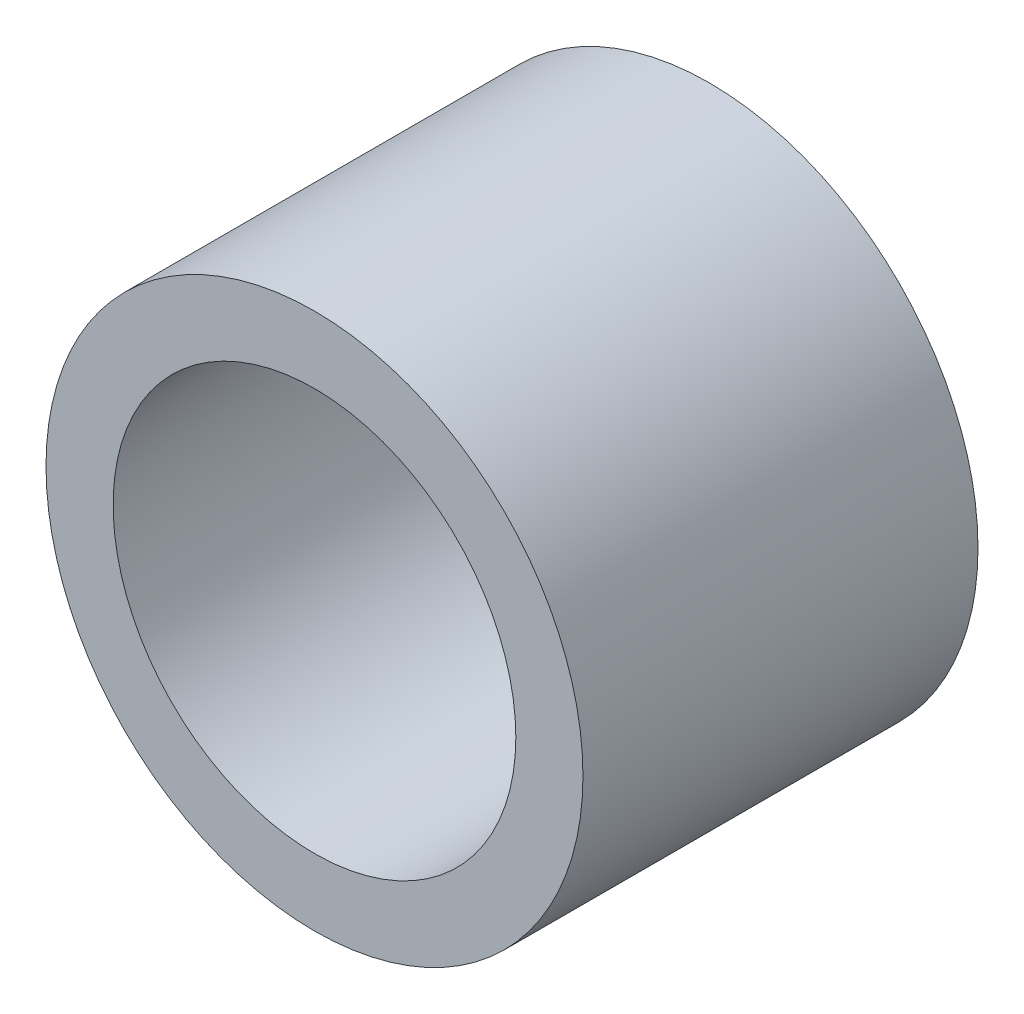
ISO-10303-21;
HEADER;
FILE_DESCRIPTION(('STEP AP214'),'2;1');
FILE_NAME('part.step','',(''),(''),'','','');
FILE_SCHEMA(('AUTOMOTIVE_DESIGN { 1 0 10303 214 1 1 1 1 }'));
ENDSEC;
DATA;
#1=APPLICATION_CONTEXT('core data for automotive mechanical design processes');
#2=APPLICATION_PROTOCOL_DEFINITION('international standard','automotive_design',2000,#1);
#3=PRODUCT_CONTEXT('',#1,'mechanical');
#4=PRODUCT('Part','Part','',(#3));
#5=PRODUCT_RELATED_PRODUCT_CATEGORY('part','',(#4));
#6=PRODUCT_DEFINITION_FORMATION('','',#4);
#7=PRODUCT_DEFINITION_CONTEXT('part definition',#1,'design');
#8=PRODUCT_DEFINITION('design','',#6,#7);
#9=PRODUCT_DEFINITION_SHAPE('','',#8);
#10=(LENGTH_UNIT() NAMED_UNIT(*) SI_UNIT(.MILLI.,.METRE.));
#11=(NAMED_UNIT(*) PLANE_ANGLE_UNIT() SI_UNIT($,.RADIAN.));
#12=(NAMED_UNIT(*) SI_UNIT($,.STERADIAN.) SOLID_ANGLE_UNIT());
#13=UNCERTAINTY_MEASURE_WITH_UNIT(LENGTH_MEASURE(1.E-05),#10,'distance_accuracy_value','');
#14=(GEOMETRIC_REPRESENTATION_CONTEXT(3) GLOBAL_UNCERTAINTY_ASSIGNED_CONTEXT((#13)) GLOBAL_UNIT_ASSIGNED_CONTEXT((#10,
#11,#12)) REPRESENTATION_CONTEXT('',''));
#15=CARTESIAN_POINT('',(0.,0.,0.));
#16=DIRECTION('',(0.,0.,1.));
#17=DIRECTION('',(1.,0.,0.));
#18=AXIS2_PLACEMENT_3D('',#15,#16,#17);
#19=CARTESIAN_POINT('',(0.,0.,10.3));
#20=DIRECTION('',(0.,0.,1.));
#21=DIRECTION('',(1.,0.,0.));
#22=AXIS2_PLACEMENT_3D('',#19,#20,#21);
#23=PLANE('',#22);
#24=CARTESIAN_POINT('',(0.,0.,10.3));
#25=DIRECTION('',(0.,0.,1.));
#26=DIRECTION('',(1.,0.,0.));
#27=AXIS2_PLACEMENT_3D('',#24,#25,#26);
#28=CIRCLE('',#27,7.);
#29=CARTESIAN_POINT('',(7.,0.,10.3));
#30=VERTEX_POINT('',#29);
#31=EDGE_CURVE('E10',#30,#30,#28,.T.);
#32=ORIENTED_EDGE('',*,*,#31,.T.);
#33=EDGE_LOOP('',(#32));
#34=FACE_BOUND('',#33,.T.);
#35=CARTESIAN_POINT('',(0.,0.,10.3));
#36=DIRECTION('',(0.,0.,1.));
#37=DIRECTION('',(1.,0.,0.));
#38=AXIS2_PLACEMENT_3D('',#35,#36,#37);
#39=CIRCLE('',#38,5.25);
#40=CARTESIAN_POINT('',(5.25,0.,10.3));
#41=VERTEX_POINT('',#40);
#42=EDGE_CURVE('E42',#41,#41,#39,.T.);
#43=ORIENTED_EDGE('',*,*,#42,.F.);
#44=EDGE_LOOP('',(#43));
#45=FACE_BOUND('',#44,.T.);
#46=ADVANCED_FACE('F31',(#34,#45),#23,.T.);
#47=CARTESIAN_POINT('',(0.,0.,0.));
#48=DIRECTION('',(0.,0.,1.));
#49=DIRECTION('',(1.,0.,0.));
#50=AXIS2_PLACEMENT_3D('',#47,#48,#49);
#51=PLANE('',#50);
#52=CARTESIAN_POINT('',(0.,0.,0.));
#53=DIRECTION('',(0.,0.,1.));
#54=DIRECTION('',(1.,0.,0.));
#55=AXIS2_PLACEMENT_3D('',#52,#53,#54);
#56=CIRCLE('',#55,7.);
#57=CARTESIAN_POINT('',(7.,0.,0.));
#58=VERTEX_POINT('',#57);
#59=EDGE_CURVE('E35',#58,#58,#56,.T.);
#60=ORIENTED_EDGE('',*,*,#59,.F.);
#61=EDGE_LOOP('',(#60));
#62=FACE_BOUND('',#61,.T.);
#63=CARTESIAN_POINT('',(0.,0.,0.));
#64=DIRECTION('',(0.,0.,1.));
#65=DIRECTION('',(1.,0.,0.));
#66=AXIS2_PLACEMENT_3D('',#63,#64,#65);
#67=CIRCLE('',#66,5.25);
#68=CARTESIAN_POINT('',(5.25,0.,0.));
#69=VERTEX_POINT('',#68);
#70=EDGE_CURVE('E44',#69,#69,#67,.T.);
#71=ORIENTED_EDGE('',*,*,#70,.T.);
#72=EDGE_LOOP('',(#71));
#73=FACE_BOUND('',#72,.T.);
#74=ADVANCED_FACE('F54',(#62,#73),#51,.F.);
#75=CARTESIAN_POINT('',(0.,0.,10.3));
#76=DIRECTION('',(0.,0.,-1.));
#77=DIRECTION('',(-1.,0.,0.));
#78=AXIS2_PLACEMENT_3D('',#75,#76,#77);
#79=CYLINDRICAL_SURFACE('',#78,7.);
#80=ORIENTED_EDGE('',*,*,#31,.F.);
#81=EDGE_LOOP('',(#80));
#82=FACE_BOUND('',#81,.T.);
#83=ORIENTED_EDGE('',*,*,#59,.T.);
#84=EDGE_LOOP('',(#83));
#85=FACE_BOUND('',#84,.T.);
#86=ADVANCED_FACE('F33',(#82,#85),#79,.T.);
#87=CARTESIAN_POINT('',(0.,0.,10.3));
#88=DIRECTION('',(0.,0.,-1.));
#89=DIRECTION('',(-1.,0.,0.));
#90=AXIS2_PLACEMENT_3D('',#87,#88,#89);
#91=CYLINDRICAL_SURFACE('',#90,5.25);
#92=ORIENTED_EDGE('',*,*,#42,.T.);
#93=EDGE_LOOP('',(#92));
#94=FACE_BOUND('',#93,.T.);
#95=ORIENTED_EDGE('',*,*,#70,.F.);
#96=EDGE_LOOP('',(#95));
#97=FACE_BOUND('',#96,.T.);
#98=ADVANCED_FACE('F50',(#94,#97),#91,.F.);
#99=CLOSED_SHELL('',(#46,#74,#86,#98));
#100=MANIFOLD_SOLID_BREP('B2',#99);
#101=ADVANCED_BREP_SHAPE_REPRESENTATION('',(#18,#100),#14);
#102=SHAPE_DEFINITION_REPRESENTATION(#9,#101);
ENDSEC;
END-ISO-10303-21;
